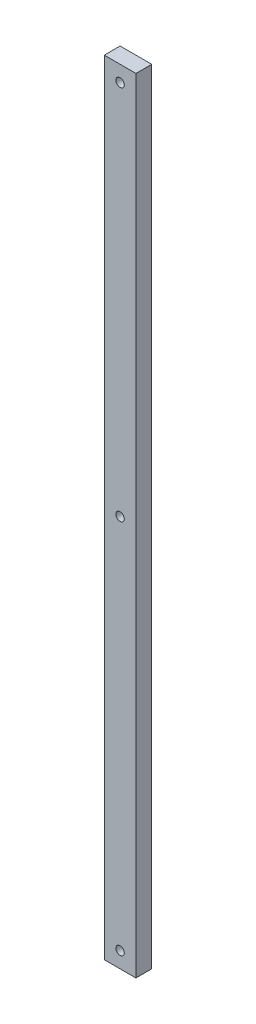
ISO-10303-21;
HEADER;
FILE_DESCRIPTION(('STEP AP214'),'2;1');
FILE_NAME('part.step','',(''),(''),'','','');
FILE_SCHEMA(('AUTOMOTIVE_DESIGN { 1 0 10303 214 1 1 1 1 }'));
ENDSEC;
DATA;
#1=APPLICATION_CONTEXT('core data for automotive mechanical design processes');
#2=APPLICATION_PROTOCOL_DEFINITION('international standard','automotive_design',2000,#1);
#3=PRODUCT_CONTEXT('',#1,'mechanical');
#4=PRODUCT('Part','Part','',(#3));
#5=PRODUCT_RELATED_PRODUCT_CATEGORY('part','',(#4));
#6=PRODUCT_DEFINITION_FORMATION('','',#4);
#7=PRODUCT_DEFINITION_CONTEXT('part definition',#1,'design');
#8=PRODUCT_DEFINITION('design','',#6,#7);
#9=PRODUCT_DEFINITION_SHAPE('','',#8);
#10=(LENGTH_UNIT() NAMED_UNIT(*) SI_UNIT(.MILLI.,.METRE.));
#11=(NAMED_UNIT(*) PLANE_ANGLE_UNIT() SI_UNIT($,.RADIAN.));
#12=(NAMED_UNIT(*) SI_UNIT($,.STERADIAN.) SOLID_ANGLE_UNIT());
#13=UNCERTAINTY_MEASURE_WITH_UNIT(LENGTH_MEASURE(1.E-05),#10,'distance_accuracy_value','');
#14=(GEOMETRIC_REPRESENTATION_CONTEXT(3) GLOBAL_UNCERTAINTY_ASSIGNED_CONTEXT((#13)) GLOBAL_UNIT_ASSIGNED_CONTEXT((#10,
#11,#12)) REPRESENTATION_CONTEXT('',''));
#15=CARTESIAN_POINT('',(0.,0.,0.));
#16=DIRECTION('',(0.,0.,1.));
#17=DIRECTION('',(1.,0.,0.));
#18=AXIS2_PLACEMENT_3D('',#15,#16,#17);
#19=CARTESIAN_POINT('',(-12.7,615.95,0.));
#20=DIRECTION('',(0.,0.,1.));
#21=DIRECTION('',(1.,0.,0.));
#22=AXIS2_PLACEMENT_3D('',#19,#20,#21);
#23=CYLINDRICAL_SURFACE('',#22,3.3655);
#24=CARTESIAN_POINT('',(-12.7,615.95,0.));
#25=DIRECTION('',(0.,0.,1.));
#26=DIRECTION('',(1.,0.,0.));
#27=AXIS2_PLACEMENT_3D('',#24,#25,#26);
#28=CIRCLE('',#27,3.3655);
#29=CARTESIAN_POINT('',(-9.33449999999996,615.95,0.));
#30=VERTEX_POINT('',#29);
#31=EDGE_CURVE('E43',#30,#30,#28,.T.);
#32=ORIENTED_EDGE('',*,*,#31,.F.);
#33=EDGE_LOOP('',(#32));
#34=FACE_BOUND('',#33,.T.);
#35=CARTESIAN_POINT('',(-12.7,615.95,12.7));
#36=DIRECTION('',(0.,0.,1.));
#37=DIRECTION('',(1.,0.,0.));
#38=AXIS2_PLACEMENT_3D('',#35,#36,#37);
#39=CIRCLE('',#38,3.3655);
#40=CARTESIAN_POINT('',(-9.33449999999996,615.95,12.7));
#41=VERTEX_POINT('',#40);
#42=EDGE_CURVE('E11',#41,#41,#39,.T.);
#43=ORIENTED_EDGE('',*,*,#42,.T.);
#44=EDGE_LOOP('',(#43));
#45=FACE_BOUND('',#44,.T.);
#46=ADVANCED_FACE('F35',(#34,#45),#23,.F.);
#47=CARTESIAN_POINT('',(0.,0.,12.7));
#48=DIRECTION('',(-1.,0.,0.));
#49=DIRECTION('',(0.,-1.,0.));
#50=AXIS2_PLACEMENT_3D('',#47,#48,#49);
#51=PLANE('',#50);
#52=DIRECTION('',(0.,1.,0.));
#53=VECTOR('',#52,1.);
#54=CARTESIAN_POINT('',(0.,0.,0.));
#55=LINE('',#54,#53);
#56=CARTESIAN_POINT('',(0.,0.,0.));
#57=VERTEX_POINT('',#56);
#58=CARTESIAN_POINT('',(0.,628.65,0.));
#59=VERTEX_POINT('',#58);
#60=EDGE_CURVE('E103',#57,#59,#55,.T.);
#61=ORIENTED_EDGE('',*,*,#60,.T.);
#62=DIRECTION('',(0.,0.,-1.));
#63=VECTOR('',#62,1.);
#64=CARTESIAN_POINT('',(0.,628.65,12.7));
#65=LINE('',#64,#63);
#66=CARTESIAN_POINT('',(0.,628.65,12.7));
#67=VERTEX_POINT('',#66);
#68=EDGE_CURVE('E94',#67,#59,#65,.T.);
#69=ORIENTED_EDGE('',*,*,#68,.F.);
#70=DIRECTION('',(0.,1.,0.));
#71=VECTOR('',#70,1.);
#72=CARTESIAN_POINT('',(0.,0.,12.7));
#73=LINE('',#72,#71);
#74=CARTESIAN_POINT('',(0.,0.,12.7));
#75=VERTEX_POINT('',#74);
#76=EDGE_CURVE('E88',#75,#67,#73,.T.);
#77=ORIENTED_EDGE('',*,*,#76,.F.);
#78=DIRECTION('',(0.,0.,-1.));
#79=VECTOR('',#78,1.);
#80=CARTESIAN_POINT('',(0.,0.,12.7));
#81=LINE('',#80,#79);
#82=EDGE_CURVE('E99',#75,#57,#81,.T.);
#83=ORIENTED_EDGE('',*,*,#82,.T.);
#84=EDGE_LOOP('',(#61,#69,#77,#83));
#85=FACE_BOUND('',#84,.T.);
#86=ADVANCED_FACE('F119',(#85),#51,.F.);
#87=CARTESIAN_POINT('',(0.,628.65,12.7));
#88=DIRECTION('',(0.,-1.,0.));
#89=DIRECTION('',(0.,0.,-1.));
#90=AXIS2_PLACEMENT_3D('',#87,#88,#89);
#91=PLANE('',#90);
#92=DIRECTION('',(-1.,0.,0.));
#93=VECTOR('',#92,1.);
#94=CARTESIAN_POINT('',(0.,628.65,0.));
#95=LINE('',#94,#93);
#96=CARTESIAN_POINT('',(-25.4,628.65,0.));
#97=VERTEX_POINT('',#96);
#98=EDGE_CURVE('E93',#59,#97,#95,.T.);
#99=ORIENTED_EDGE('',*,*,#98,.T.);
#100=DIRECTION('',(0.,0.,-1.));
#101=VECTOR('',#100,1.);
#102=CARTESIAN_POINT('',(-25.4,628.65,12.7));
#103=LINE('',#102,#101);
#104=CARTESIAN_POINT('',(-25.4,628.65,12.7));
#105=VERTEX_POINT('',#104);
#106=EDGE_CURVE('E91',#105,#97,#103,.T.);
#107=ORIENTED_EDGE('',*,*,#106,.F.);
#108=DIRECTION('',(-1.,0.,0.));
#109=VECTOR('',#108,1.);
#110=CARTESIAN_POINT('',(0.,628.65,12.7));
#111=LINE('',#110,#109);
#112=EDGE_CURVE('E82',#67,#105,#111,.T.);
#113=ORIENTED_EDGE('',*,*,#112,.F.);
#114=ORIENTED_EDGE('',*,*,#68,.T.);
#115=EDGE_LOOP('',(#99,#107,#113,#114));
#116=FACE_BOUND('',#115,.T.);
#117=ADVANCED_FACE('F92',(#116),#91,.F.);
#118=CARTESIAN_POINT('',(-25.4,0.,12.7));
#119=DIRECTION('',(1.,0.,0.));
#120=DIRECTION('',(0.,1.,0.));
#121=AXIS2_PLACEMENT_3D('',#118,#119,#120);
#122=PLANE('',#121);
#123=DIRECTION('',(0.,-1.,0.));
#124=VECTOR('',#123,1.);
#125=CARTESIAN_POINT('',(-25.4,0.,0.));
#126=LINE('',#125,#124);
#127=CARTESIAN_POINT('',(-25.4,0.,0.));
#128=VERTEX_POINT('',#127);
#129=EDGE_CURVE('E68',#97,#128,#126,.T.);
#130=ORIENTED_EDGE('',*,*,#129,.T.);
#131=DIRECTION('',(0.,0.,-1.));
#132=VECTOR('',#131,1.);
#133=CARTESIAN_POINT('',(-25.4,0.,12.7));
#134=LINE('',#133,#132);
#135=CARTESIAN_POINT('',(-25.4,0.,12.7));
#136=VERTEX_POINT('',#135);
#137=EDGE_CURVE('E95',#136,#128,#134,.T.);
#138=ORIENTED_EDGE('',*,*,#137,.F.);
#139=DIRECTION('',(0.,-1.,0.));
#140=VECTOR('',#139,1.);
#141=CARTESIAN_POINT('',(-25.4,0.,12.7));
#142=LINE('',#141,#140);
#143=EDGE_CURVE('E86',#105,#136,#142,.T.);
#144=ORIENTED_EDGE('',*,*,#143,.F.);
#145=ORIENTED_EDGE('',*,*,#106,.T.);
#146=EDGE_LOOP('',(#130,#138,#144,#145));
#147=FACE_BOUND('',#146,.T.);
#148=ADVANCED_FACE('F97',(#147),#122,.F.);
#149=CARTESIAN_POINT('',(0.,0.,12.7));
#150=DIRECTION('',(0.,1.,0.));
#151=DIRECTION('',(-1.,0.,0.));
#152=AXIS2_PLACEMENT_3D('',#149,#150,#151);
#153=PLANE('',#152);
#154=DIRECTION('',(1.,0.,0.));
#155=VECTOR('',#154,1.);
#156=CARTESIAN_POINT('',(0.,0.,0.));
#157=LINE('',#156,#155);
#158=EDGE_CURVE('E74',#128,#57,#157,.T.);
#159=ORIENTED_EDGE('',*,*,#158,.T.);
#160=ORIENTED_EDGE('',*,*,#82,.F.);
#161=DIRECTION('',(1.,0.,0.));
#162=VECTOR('',#161,1.);
#163=CARTESIAN_POINT('',(0.,0.,12.7));
#164=LINE('',#163,#162);
#165=EDGE_CURVE('E51',#136,#75,#164,.T.);
#166=ORIENTED_EDGE('',*,*,#165,.F.);
#167=ORIENTED_EDGE('',*,*,#137,.T.);
#168=EDGE_LOOP('',(#159,#160,#166,#167));
#169=FACE_BOUND('',#168,.T.);
#170=ADVANCED_FACE('F122',(#169),#153,.F.);
#171=CARTESIAN_POINT('',(0.,0.,12.7));
#172=DIRECTION('',(0.,0.,1.));
#173=DIRECTION('',(1.,0.,0.));
#174=AXIS2_PLACEMENT_3D('',#171,#172,#173);
#175=PLANE('',#174);
#176=CARTESIAN_POINT('',(-12.7,314.325,12.7));
#177=DIRECTION('',(0.,0.,1.));
#178=DIRECTION('',(1.,0.,0.));
#179=AXIS2_PLACEMENT_3D('',#176,#177,#178);
#180=CIRCLE('',#179,3.3655);
#181=CARTESIAN_POINT('',(-9.33449999999996,314.325,12.7));
#182=VERTEX_POINT('',#181);
#183=EDGE_CURVE('E151',#182,#182,#180,.T.);
#184=ORIENTED_EDGE('',*,*,#183,.F.);
#185=EDGE_LOOP('',(#184));
#186=FACE_BOUND('',#185,.T.);
#187=CARTESIAN_POINT('',(-12.7,12.7,12.7));
#188=DIRECTION('',(0.,0.,1.));
#189=DIRECTION('',(1.,0.,0.));
#190=AXIS2_PLACEMENT_3D('',#187,#188,#189);
#191=CIRCLE('',#190,3.3655);
#192=CARTESIAN_POINT('',(-9.33449999999996,12.7,12.7));
#193=VERTEX_POINT('',#192);
#194=EDGE_CURVE('E148',#193,#193,#191,.T.);
#195=ORIENTED_EDGE('',*,*,#194,.F.);
#196=EDGE_LOOP('',(#195));
#197=FACE_BOUND('',#196,.T.);
#198=ORIENTED_EDGE('',*,*,#76,.T.);
#199=ORIENTED_EDGE('',*,*,#112,.T.);
#200=ORIENTED_EDGE('',*,*,#143,.T.);
#201=ORIENTED_EDGE('',*,*,#165,.T.);
#202=EDGE_LOOP('',(#198,#199,#200,#201));
#203=FACE_BOUND('',#202,.T.);
#204=ORIENTED_EDGE('',*,*,#42,.F.);
#205=EDGE_LOOP('',(#204));
#206=FACE_BOUND('',#205,.T.);
#207=ADVANCED_FACE('F83',(#186,#197,#203,#206),#175,.T.);
#208=CARTESIAN_POINT('',(0.,0.,0.));
#209=DIRECTION('',(0.,0.,1.));
#210=DIRECTION('',(1.,0.,0.));
#211=AXIS2_PLACEMENT_3D('',#208,#209,#210);
#212=PLANE('',#211);
#213=CARTESIAN_POINT('',(-12.7,314.325,0.));
#214=DIRECTION('',(0.,0.,1.));
#215=DIRECTION('',(1.,0.,0.));
#216=AXIS2_PLACEMENT_3D('',#213,#214,#215);
#217=CIRCLE('',#216,3.3655);
#218=CARTESIAN_POINT('',(-9.33449999999996,314.325,0.));
#219=VERTEX_POINT('',#218);
#220=EDGE_CURVE('E156',#219,#219,#217,.T.);
#221=ORIENTED_EDGE('',*,*,#220,.T.);
#222=EDGE_LOOP('',(#221));
#223=FACE_BOUND('',#222,.T.);
#224=CARTESIAN_POINT('',(-12.7,12.7,0.));
#225=DIRECTION('',(0.,0.,1.));
#226=DIRECTION('',(1.,0.,0.));
#227=AXIS2_PLACEMENT_3D('',#224,#225,#226);
#228=CIRCLE('',#227,3.3655);
#229=CARTESIAN_POINT('',(-9.33449999999996,12.7,0.));
#230=VERTEX_POINT('',#229);
#231=EDGE_CURVE('E106',#230,#230,#228,.T.);
#232=ORIENTED_EDGE('',*,*,#231,.T.);
#233=EDGE_LOOP('',(#232));
#234=FACE_BOUND('',#233,.T.);
#235=ORIENTED_EDGE('',*,*,#60,.F.);
#236=ORIENTED_EDGE('',*,*,#158,.F.);
#237=ORIENTED_EDGE('',*,*,#129,.F.);
#238=ORIENTED_EDGE('',*,*,#98,.F.);
#239=EDGE_LOOP('',(#235,#236,#237,#238));
#240=FACE_BOUND('',#239,.T.);
#241=ORIENTED_EDGE('',*,*,#31,.T.);
#242=EDGE_LOOP('',(#241));
#243=FACE_BOUND('',#242,.T.);
#244=ADVANCED_FACE('F115',(#223,#234,#240,#243),#212,.F.);
#245=CARTESIAN_POINT('',(-12.7,12.7,0.));
#246=DIRECTION('',(0.,0.,1.));
#247=DIRECTION('',(1.,0.,0.));
#248=AXIS2_PLACEMENT_3D('',#245,#246,#247);
#249=CYLINDRICAL_SURFACE('',#248,3.3655);
#250=ORIENTED_EDGE('',*,*,#231,.F.);
#251=EDGE_LOOP('',(#250));
#252=FACE_BOUND('',#251,.T.);
#253=ORIENTED_EDGE('',*,*,#194,.T.);
#254=EDGE_LOOP('',(#253));
#255=FACE_BOUND('',#254,.T.);
#256=ADVANCED_FACE('F129',(#252,#255),#249,.F.);
#257=CARTESIAN_POINT('',(-12.7,314.325,0.));
#258=DIRECTION('',(0.,0.,1.));
#259=DIRECTION('',(1.,0.,0.));
#260=AXIS2_PLACEMENT_3D('',#257,#258,#259);
#261=CYLINDRICAL_SURFACE('',#260,3.3655);
#262=ORIENTED_EDGE('',*,*,#220,.F.);
#263=EDGE_LOOP('',(#262));
#264=FACE_BOUND('',#263,.T.);
#265=ORIENTED_EDGE('',*,*,#183,.T.);
#266=EDGE_LOOP('',(#265));
#267=FACE_BOUND('',#266,.T.);
#268=ADVANCED_FACE('F161',(#264,#267),#261,.F.);
#269=CLOSED_SHELL('',(#46,#86,#117,#148,#170,#207,#244,#256,#268));
#270=MANIFOLD_SOLID_BREP('B2',#269);
#271=ADVANCED_BREP_SHAPE_REPRESENTATION('',(#18,#270),#14);
#272=SHAPE_DEFINITION_REPRESENTATION(#9,#271);
ENDSEC;
END-ISO-10303-21;
